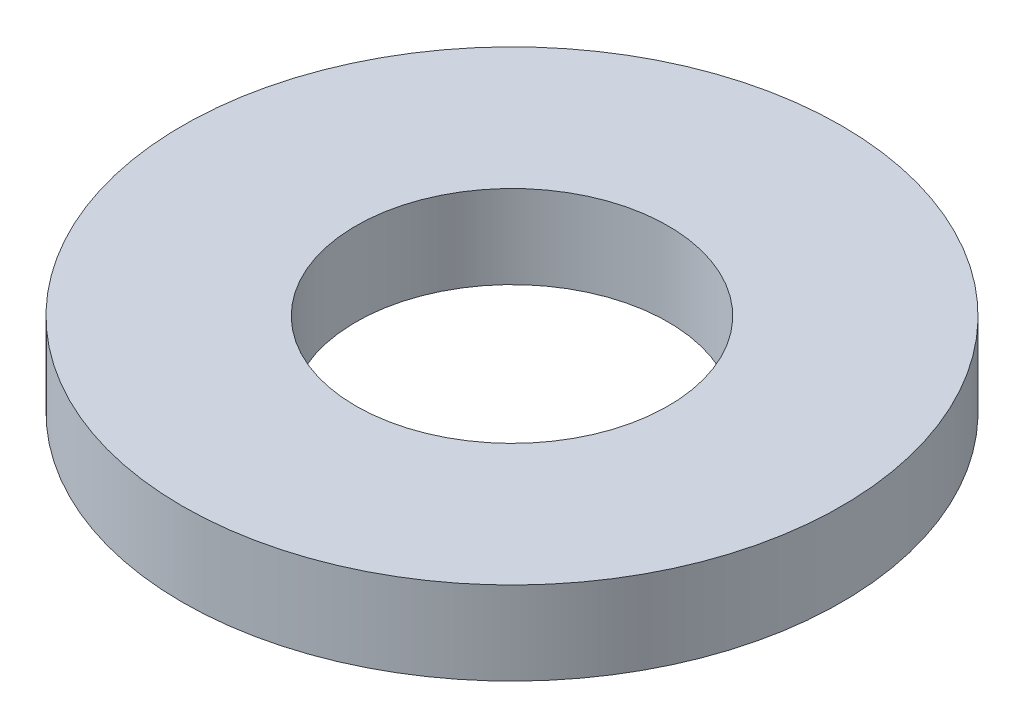
ISO-10303-21;
HEADER;
FILE_DESCRIPTION(('STEP AP214'),'2;1');
FILE_NAME('part.step','',(''),(''),'','','');
FILE_SCHEMA(('AUTOMOTIVE_DESIGN { 1 0 10303 214 1 1 1 1 }'));
ENDSEC;
DATA;
#1=APPLICATION_CONTEXT('core data for automotive mechanical design processes');
#2=APPLICATION_PROTOCOL_DEFINITION('international standard','automotive_design',2000,#1);
#3=PRODUCT_CONTEXT('',#1,'mechanical');
#4=PRODUCT('Part','Part','',(#3));
#5=PRODUCT_RELATED_PRODUCT_CATEGORY('part','',(#4));
#6=PRODUCT_DEFINITION_FORMATION('','',#4);
#7=PRODUCT_DEFINITION_CONTEXT('part definition',#1,'design');
#8=PRODUCT_DEFINITION('design','',#6,#7);
#9=PRODUCT_DEFINITION_SHAPE('','',#8);
#10=(LENGTH_UNIT() NAMED_UNIT(*) SI_UNIT(.MILLI.,.METRE.));
#11=(NAMED_UNIT(*) PLANE_ANGLE_UNIT() SI_UNIT($,.RADIAN.));
#12=(NAMED_UNIT(*) SI_UNIT($,.STERADIAN.) SOLID_ANGLE_UNIT());
#13=UNCERTAINTY_MEASURE_WITH_UNIT(LENGTH_MEASURE(1.E-05),#10,'distance_accuracy_value','');
#14=(GEOMETRIC_REPRESENTATION_CONTEXT(3) GLOBAL_UNCERTAINTY_ASSIGNED_CONTEXT((#13)) GLOBAL_UNIT_ASSIGNED_CONTEXT((#10,
#11,#12)) REPRESENTATION_CONTEXT('',''));
#15=CARTESIAN_POINT('',(0.,0.,0.));
#16=DIRECTION('',(0.,0.,1.));
#17=DIRECTION('',(1.,0.,0.));
#18=AXIS2_PLACEMENT_3D('',#15,#16,#17);
#19=CARTESIAN_POINT('',(0.,12.,0.));
#20=DIRECTION('',(0.,-1.,0.));
#21=DIRECTION('',(0.,0.,-1.));
#22=AXIS2_PLACEMENT_3D('',#19,#20,#21);
#23=CYLINDRICAL_SURFACE('',#22,47.5);
#24=CARTESIAN_POINT('',(0.,12.,0.));
#25=DIRECTION('',(0.,1.,0.));
#26=DIRECTION('',(0.,0.,1.));
#27=AXIS2_PLACEMENT_3D('',#24,#25,#26);
#28=CIRCLE('',#27,47.5);
#29=CARTESIAN_POINT('',(0.,12.,47.5));
#30=VERTEX_POINT('',#29);
#31=EDGE_CURVE('E10',#30,#30,#28,.T.);
#32=ORIENTED_EDGE('',*,*,#31,.F.);
#33=EDGE_LOOP('',(#32));
#34=FACE_BOUND('',#33,.T.);
#35=CARTESIAN_POINT('',(0.,0.,0.));
#36=DIRECTION('',(0.,1.,0.));
#37=DIRECTION('',(0.,0.,1.));
#38=AXIS2_PLACEMENT_3D('',#35,#36,#37);
#39=CIRCLE('',#38,47.5);
#40=CARTESIAN_POINT('',(0.,0.,47.5));
#41=VERTEX_POINT('',#40);
#42=EDGE_CURVE('E37',#41,#41,#39,.T.);
#43=ORIENTED_EDGE('',*,*,#42,.T.);
#44=EDGE_LOOP('',(#43));
#45=FACE_BOUND('',#44,.T.);
#46=ADVANCED_FACE('F40',(#34,#45),#23,.T.);
#47=CARTESIAN_POINT('',(0.,12.,0.));
#48=DIRECTION('',(0.,1.,0.));
#49=DIRECTION('',(0.,0.,1.));
#50=AXIS2_PLACEMENT_3D('',#47,#48,#49);
#51=PLANE('',#50);
#52=CARTESIAN_POINT('',(0.,12.,0.));
#53=DIRECTION('',(0.,1.,0.));
#54=DIRECTION('',(0.,0.,1.));
#55=AXIS2_PLACEMENT_3D('',#52,#53,#54);
#56=CIRCLE('',#55,22.5);
#57=CARTESIAN_POINT('',(0.,12.,22.5));
#58=VERTEX_POINT('',#57);
#59=EDGE_CURVE('E50',#58,#58,#56,.T.);
#60=ORIENTED_EDGE('',*,*,#59,.F.);
#61=EDGE_LOOP('',(#60));
#62=FACE_BOUND('',#61,.T.);
#63=ORIENTED_EDGE('',*,*,#31,.T.);
#64=EDGE_LOOP('',(#63));
#65=FACE_BOUND('',#64,.T.);
#66=ADVANCED_FACE('F59',(#62,#65),#51,.T.);
#67=CARTESIAN_POINT('',(0.,0.,0.));
#68=DIRECTION('',(0.,1.,0.));
#69=DIRECTION('',(0.,0.,1.));
#70=AXIS2_PLACEMENT_3D('',#67,#68,#69);
#71=PLANE('',#70);
#72=CARTESIAN_POINT('',(0.,0.,0.));
#73=DIRECTION('',(0.,1.,0.));
#74=DIRECTION('',(0.,0.,1.));
#75=AXIS2_PLACEMENT_3D('',#72,#73,#74);
#76=CIRCLE('',#75,22.5);
#77=CARTESIAN_POINT('',(0.,0.,22.5));
#78=VERTEX_POINT('',#77);
#79=EDGE_CURVE('E47',#78,#78,#76,.T.);
#80=ORIENTED_EDGE('',*,*,#79,.T.);
#81=EDGE_LOOP('',(#80));
#82=FACE_BOUND('',#81,.T.);
#83=ORIENTED_EDGE('',*,*,#42,.F.);
#84=EDGE_LOOP('',(#83));
#85=FACE_BOUND('',#84,.T.);
#86=ADVANCED_FACE('F58',(#82,#85),#71,.F.);
#87=CARTESIAN_POINT('',(0.,12.,0.));
#88=DIRECTION('',(0.,-1.,0.));
#89=DIRECTION('',(0.,0.,-1.));
#90=AXIS2_PLACEMENT_3D('',#87,#88,#89);
#91=CYLINDRICAL_SURFACE('',#90,22.5);
#92=ORIENTED_EDGE('',*,*,#59,.T.);
#93=EDGE_LOOP('',(#92));
#94=FACE_BOUND('',#93,.T.);
#95=ORIENTED_EDGE('',*,*,#79,.F.);
#96=EDGE_LOOP('',(#95));
#97=FACE_BOUND('',#96,.T.);
#98=ADVANCED_FACE('F54',(#94,#97),#91,.F.);
#99=CLOSED_SHELL('',(#46,#66,#86,#98));
#100=MANIFOLD_SOLID_BREP('B2',#99);
#101=ADVANCED_BREP_SHAPE_REPRESENTATION('',(#18,#100),#14);
#102=SHAPE_DEFINITION_REPRESENTATION(#9,#101);
ENDSEC;
END-ISO-10303-21;
